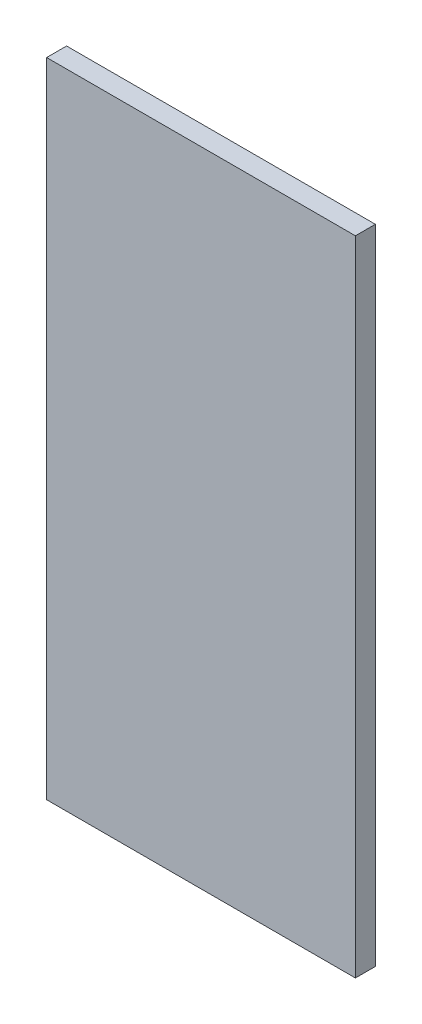
ISO-10303-21;
HEADER;
FILE_DESCRIPTION(('STEP AP214'),'2;1');
FILE_NAME('part.step','',(''),(''),'','','');
FILE_SCHEMA(('AUTOMOTIVE_DESIGN { 1 0 10303 214 1 1 1 1 }'));
ENDSEC;
DATA;
#1=APPLICATION_CONTEXT('core data for automotive mechanical design processes');
#2=APPLICATION_PROTOCOL_DEFINITION('international standard','automotive_design',2000,#1);
#3=PRODUCT_CONTEXT('',#1,'mechanical');
#4=PRODUCT('Part','Part','',(#3));
#5=PRODUCT_RELATED_PRODUCT_CATEGORY('part','',(#4));
#6=PRODUCT_DEFINITION_FORMATION('','',#4);
#7=PRODUCT_DEFINITION_CONTEXT('part definition',#1,'design');
#8=PRODUCT_DEFINITION('design','',#6,#7);
#9=PRODUCT_DEFINITION_SHAPE('','',#8);
#10=(LENGTH_UNIT() NAMED_UNIT(*) SI_UNIT(.MILLI.,.METRE.));
#11=(NAMED_UNIT(*) PLANE_ANGLE_UNIT() SI_UNIT($,.RADIAN.));
#12=(NAMED_UNIT(*) SI_UNIT($,.STERADIAN.) SOLID_ANGLE_UNIT());
#13=UNCERTAINTY_MEASURE_WITH_UNIT(LENGTH_MEASURE(1.E-05),#10,'distance_accuracy_value','');
#14=(GEOMETRIC_REPRESENTATION_CONTEXT(3) GLOBAL_UNCERTAINTY_ASSIGNED_CONTEXT((#13)) GLOBAL_UNIT_ASSIGNED_CONTEXT((#10,
#11,#12)) REPRESENTATION_CONTEXT('',''));
#15=CARTESIAN_POINT('',(0.,0.,0.));
#16=DIRECTION('',(0.,0.,1.));
#17=DIRECTION('',(1.,0.,0.));
#18=AXIS2_PLACEMENT_3D('',#15,#16,#17);
#19=CARTESIAN_POINT('',(87.0419998168945,102.857002258301,0.));
#20=DIRECTION('',(1.,0.,0.));
#21=DIRECTION('',(0.,-1.,0.));
#22=AXIS2_PLACEMENT_3D('',#19,#20,#21);
#23=PLANE('',#22);
#24=DIRECTION('',(0.,-1.,0.));
#25=VECTOR('',#24,1.);
#26=CARTESIAN_POINT('',(87.0419998168945,102.857002258301,0.03556));
#27=LINE('',#26,#25);
#28=CARTESIAN_POINT('',(87.0419998168945,102.857002258301,0.03556));
#29=VERTEX_POINT('',#28);
#30=CARTESIAN_POINT('',(87.0419998168945,101.71199798584,0.03556));
#31=VERTEX_POINT('',#30);
#32=EDGE_CURVE('E11',#29,#31,#27,.T.);
#33=ORIENTED_EDGE('',*,*,#32,.F.);
#34=DIRECTION('',(0.,0.,1.));
#35=VECTOR('',#34,1.);
#36=CARTESIAN_POINT('',(87.0419998168945,102.857002258301,0.));
#37=LINE('',#36,#35);
#38=CARTESIAN_POINT('',(87.0419998168945,102.857002258301,0.));
#39=VERTEX_POINT('',#38);
#40=EDGE_CURVE('E24',#39,#29,#37,.T.);
#41=ORIENTED_EDGE('',*,*,#40,.F.);
#42=DIRECTION('',(0.,-1.,0.));
#43=VECTOR('',#42,1.);
#44=CARTESIAN_POINT('',(87.0419998168945,102.857002258301,0.));
#45=LINE('',#44,#43);
#46=CARTESIAN_POINT('',(87.0419998168945,101.71199798584,0.));
#47=VERTEX_POINT('',#46);
#48=EDGE_CURVE('E75',#39,#47,#45,.T.);
#49=ORIENTED_EDGE('',*,*,#48,.T.);
#50=DIRECTION('',(0.,0.,1.));
#51=VECTOR('',#50,1.);
#52=CARTESIAN_POINT('',(87.0419998168945,101.71199798584,0.));
#53=LINE('',#52,#51);
#54=EDGE_CURVE('E37',#47,#31,#53,.T.);
#55=ORIENTED_EDGE('',*,*,#54,.T.);
#56=EDGE_LOOP('',(#33,#41,#49,#55));
#57=FACE_BOUND('',#56,.T.);
#58=ADVANCED_FACE('F17',(#57),#23,.F.);
#59=CARTESIAN_POINT('',(87.0419998168945,101.71199798584,0.));
#60=DIRECTION('',(0.,1.,0.));
#61=DIRECTION('',(1.,0.,0.));
#62=AXIS2_PLACEMENT_3D('',#59,#60,#61);
#63=PLANE('',#62);
#64=DIRECTION('',(1.,0.,0.));
#65=VECTOR('',#64,1.);
#66=CARTESIAN_POINT('',(87.0419998168945,101.71199798584,0.03556));
#67=LINE('',#66,#65);
#68=CARTESIAN_POINT('',(87.5920028686523,101.71199798584,0.03556));
#69=VERTEX_POINT('',#68);
#70=EDGE_CURVE('E83',#31,#69,#67,.T.);
#71=ORIENTED_EDGE('',*,*,#70,.F.);
#72=ORIENTED_EDGE('',*,*,#54,.F.);
#73=DIRECTION('',(1.,0.,0.));
#74=VECTOR('',#73,1.);
#75=CARTESIAN_POINT('',(87.0419998168945,101.71199798584,0.));
#76=LINE('',#75,#74);
#77=CARTESIAN_POINT('',(87.5920028686523,101.71199798584,0.));
#78=VERTEX_POINT('',#77);
#79=EDGE_CURVE('E81',#47,#78,#76,.T.);
#80=ORIENTED_EDGE('',*,*,#79,.T.);
#81=DIRECTION('',(0.,0.,1.));
#82=VECTOR('',#81,1.);
#83=CARTESIAN_POINT('',(87.5920028686523,101.71199798584,0.));
#84=LINE('',#83,#82);
#85=EDGE_CURVE('E67',#78,#69,#84,.T.);
#86=ORIENTED_EDGE('',*,*,#85,.T.);
#87=EDGE_LOOP('',(#71,#72,#80,#86));
#88=FACE_BOUND('',#87,.T.);
#89=ADVANCED_FACE('F89',(#88),#63,.F.);
#90=CARTESIAN_POINT('',(87.5920028686523,101.71199798584,0.));
#91=DIRECTION('',(-1.,0.,0.));
#92=DIRECTION('',(0.,1.,0.));
#93=AXIS2_PLACEMENT_3D('',#90,#91,#92);
#94=PLANE('',#93);
#95=DIRECTION('',(0.,1.,0.));
#96=VECTOR('',#95,1.);
#97=CARTESIAN_POINT('',(87.5920028686523,101.71199798584,0.03556));
#98=LINE('',#97,#96);
#99=CARTESIAN_POINT('',(87.5920028686523,102.857002258301,0.03556));
#100=VERTEX_POINT('',#99);
#101=EDGE_CURVE('E71',#69,#100,#98,.T.);
#102=ORIENTED_EDGE('',*,*,#101,.F.);
#103=ORIENTED_EDGE('',*,*,#85,.F.);
#104=DIRECTION('',(0.,1.,0.));
#105=VECTOR('',#104,1.);
#106=CARTESIAN_POINT('',(87.5920028686523,101.71199798584,0.));
#107=LINE('',#106,#105);
#108=CARTESIAN_POINT('',(87.5920028686523,102.857002258301,0.));
#109=VERTEX_POINT('',#108);
#110=EDGE_CURVE('E63',#78,#109,#107,.T.);
#111=ORIENTED_EDGE('',*,*,#110,.T.);
#112=DIRECTION('',(0.,0.,1.));
#113=VECTOR('',#112,1.);
#114=CARTESIAN_POINT('',(87.5920028686523,102.857002258301,0.));
#115=LINE('',#114,#113);
#116=EDGE_CURVE('E53',#109,#100,#115,.T.);
#117=ORIENTED_EDGE('',*,*,#116,.T.);
#118=EDGE_LOOP('',(#102,#103,#111,#117));
#119=FACE_BOUND('',#118,.T.);
#120=ADVANCED_FACE('F66',(#119),#94,.F.);
#121=CARTESIAN_POINT('',(87.5920028686523,102.857002258301,0.));
#122=DIRECTION('',(0.,-1.,0.));
#123=DIRECTION('',(-1.,0.,0.));
#124=AXIS2_PLACEMENT_3D('',#121,#122,#123);
#125=PLANE('',#124);
#126=DIRECTION('',(-1.,0.,0.));
#127=VECTOR('',#126,1.);
#128=CARTESIAN_POINT('',(87.5920028686523,102.857002258301,0.03556));
#129=LINE('',#128,#127);
#130=EDGE_CURVE('E59',#100,#29,#129,.T.);
#131=ORIENTED_EDGE('',*,*,#130,.F.);
#132=ORIENTED_EDGE('',*,*,#116,.F.);
#133=DIRECTION('',(-1.,0.,0.));
#134=VECTOR('',#133,1.);
#135=CARTESIAN_POINT('',(87.5920028686523,102.857002258301,0.));
#136=LINE('',#135,#134);
#137=EDGE_CURVE('E57',#109,#39,#136,.T.);
#138=ORIENTED_EDGE('',*,*,#137,.T.);
#139=ORIENTED_EDGE('',*,*,#40,.T.);
#140=EDGE_LOOP('',(#131,#132,#138,#139));
#141=FACE_BOUND('',#140,.T.);
#142=ADVANCED_FACE('F55',(#141),#125,.F.);
#143=CARTESIAN_POINT('',(87.0419998168945,102.857002258301,0.));
#144=DIRECTION('',(0.,0.,-1.));
#145=DIRECTION('',(-1.,0.,0.));
#146=AXIS2_PLACEMENT_3D('',#143,#144,#145);
#147=PLANE('',#146);
#148=ORIENTED_EDGE('',*,*,#137,.F.);
#149=ORIENTED_EDGE('',*,*,#110,.F.);
#150=ORIENTED_EDGE('',*,*,#79,.F.);
#151=ORIENTED_EDGE('',*,*,#48,.F.);
#152=EDGE_LOOP('',(#148,#149,#150,#151));
#153=FACE_BOUND('',#152,.T.);
#154=ADVANCED_FACE('F74',(#153),#147,.T.);
#155=CARTESIAN_POINT('',(87.0419998168945,102.857002258301,0.03556));
#156=DIRECTION('',(0.,0.,-1.));
#157=DIRECTION('',(-1.,0.,0.));
#158=AXIS2_PLACEMENT_3D('',#155,#156,#157);
#159=PLANE('',#158);
#160=ORIENTED_EDGE('',*,*,#32,.T.);
#161=ORIENTED_EDGE('',*,*,#70,.T.);
#162=ORIENTED_EDGE('',*,*,#101,.T.);
#163=ORIENTED_EDGE('',*,*,#130,.T.);
#164=EDGE_LOOP('',(#160,#161,#162,#163));
#165=FACE_BOUND('',#164,.T.);
#166=ADVANCED_FACE('F91',(#165),#159,.F.);
#167=CLOSED_SHELL('',(#58,#89,#120,#142,#154,#166));
#168=MANIFOLD_SOLID_BREP('B1',#167);
#169=ADVANCED_BREP_SHAPE_REPRESENTATION('',(#18,#168),#14);
#170=SHAPE_DEFINITION_REPRESENTATION(#9,#169);
ENDSEC;
END-ISO-10303-21;
